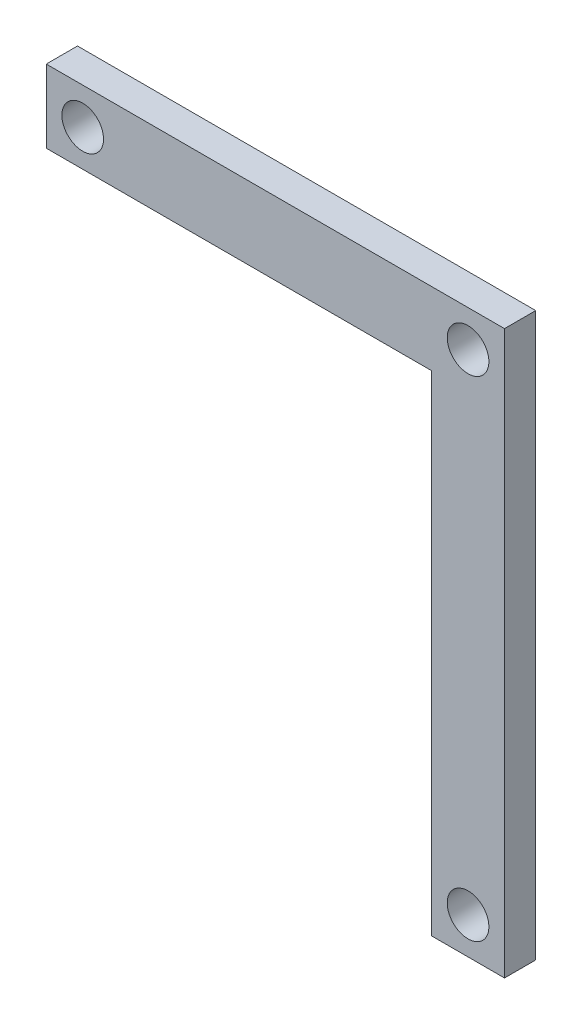
ISO-10303-21;
HEADER;
FILE_DESCRIPTION(('STEP AP214'),'2;1');
FILE_NAME('part.step','',(''),(''),'','','');
FILE_SCHEMA(('AUTOMOTIVE_DESIGN { 1 0 10303 214 1 1 1 1 }'));
ENDSEC;
DATA;
#1=APPLICATION_CONTEXT('core data for automotive mechanical design processes');
#2=APPLICATION_PROTOCOL_DEFINITION('international standard','automotive_design',2000,#1);
#3=PRODUCT_CONTEXT('',#1,'mechanical');
#4=PRODUCT('Part','Part','',(#3));
#5=PRODUCT_RELATED_PRODUCT_CATEGORY('part','',(#4));
#6=PRODUCT_DEFINITION_FORMATION('','',#4);
#7=PRODUCT_DEFINITION_CONTEXT('part definition',#1,'design');
#8=PRODUCT_DEFINITION('design','',#6,#7);
#9=PRODUCT_DEFINITION_SHAPE('','',#8);
#10=(LENGTH_UNIT() NAMED_UNIT(*) SI_UNIT(.MILLI.,.METRE.));
#11=(NAMED_UNIT(*) PLANE_ANGLE_UNIT() SI_UNIT($,.RADIAN.));
#12=(NAMED_UNIT(*) SI_UNIT($,.STERADIAN.) SOLID_ANGLE_UNIT());
#13=UNCERTAINTY_MEASURE_WITH_UNIT(LENGTH_MEASURE(1.E-05),#10,'distance_accuracy_value','');
#14=(GEOMETRIC_REPRESENTATION_CONTEXT(3) GLOBAL_UNCERTAINTY_ASSIGNED_CONTEXT((#13)) GLOBAL_UNIT_ASSIGNED_CONTEXT((#10,
#11,#12)) REPRESENTATION_CONTEXT('',''));
#15=CARTESIAN_POINT('',(0.,0.,0.));
#16=DIRECTION('',(0.,0.,1.));
#17=DIRECTION('',(1.,0.,0.));
#18=AXIS2_PLACEMENT_3D('',#15,#16,#17);
#19=CARTESIAN_POINT('',(0.,-270.,15.));
#20=DIRECTION('',(-1.,0.,0.));
#21=DIRECTION('',(0.,0.,1.));
#22=AXIS2_PLACEMENT_3D('',#19,#20,#21);
#23=PLANE('',#22);
#24=DIRECTION('',(0.,1.,0.));
#25=VECTOR('',#24,1.);
#26=CARTESIAN_POINT('',(0.,-270.,0.));
#27=LINE('',#26,#25);
#28=CARTESIAN_POINT('',(0.,-270.,0.));
#29=VERTEX_POINT('',#28);
#30=CARTESIAN_POINT('',(0.,0.,0.));
#31=VERTEX_POINT('',#30);
#32=EDGE_CURVE('E117',#29,#31,#27,.T.);
#33=ORIENTED_EDGE('',*,*,#32,.T.);
#34=DIRECTION('',(0.,0.,-1.));
#35=VECTOR('',#34,1.);
#36=CARTESIAN_POINT('',(0.,0.,15.));
#37=LINE('',#36,#35);
#38=CARTESIAN_POINT('',(0.,0.,15.));
#39=VERTEX_POINT('',#38);
#40=EDGE_CURVE('E11',#39,#31,#37,.T.);
#41=ORIENTED_EDGE('',*,*,#40,.F.);
#42=DIRECTION('',(0.,1.,0.));
#43=VECTOR('',#42,1.);
#44=CARTESIAN_POINT('',(0.,-270.,15.));
#45=LINE('',#44,#43);
#46=CARTESIAN_POINT('',(0.,-270.,15.));
#47=VERTEX_POINT('',#46);
#48=EDGE_CURVE('E128',#47,#39,#45,.T.);
#49=ORIENTED_EDGE('',*,*,#48,.F.);
#50=DIRECTION('',(0.,0.,-1.));
#51=VECTOR('',#50,1.);
#52=CARTESIAN_POINT('',(0.,-270.,15.));
#53=LINE('',#52,#51);
#54=EDGE_CURVE('E113',#47,#29,#53,.T.);
#55=ORIENTED_EDGE('',*,*,#54,.T.);
#56=EDGE_LOOP('',(#33,#41,#49,#55));
#57=FACE_BOUND('',#56,.T.);
#58=ADVANCED_FACE('F32',(#57),#23,.F.);
#59=CARTESIAN_POINT('',(0.,0.,15.));
#60=DIRECTION('',(0.,-1.,0.));
#61=DIRECTION('',(1.,0.,0.));
#62=AXIS2_PLACEMENT_3D('',#59,#60,#61);
#63=PLANE('',#62);
#64=DIRECTION('',(-1.,0.,0.));
#65=VECTOR('',#64,1.);
#66=CARTESIAN_POINT('',(0.,0.,0.));
#67=LINE('',#66,#65);
#68=CARTESIAN_POINT('',(-220.,0.,0.));
#69=VERTEX_POINT('',#68);
#70=EDGE_CURVE('E120',#31,#69,#67,.T.);
#71=ORIENTED_EDGE('',*,*,#70,.T.);
#72=DIRECTION('',(0.,0.,-1.));
#73=VECTOR('',#72,1.);
#74=CARTESIAN_POINT('',(-220.,0.,15.));
#75=LINE('',#74,#73);
#76=CARTESIAN_POINT('',(-220.,0.,15.));
#77=VERTEX_POINT('',#76);
#78=EDGE_CURVE('E41',#77,#69,#75,.T.);
#79=ORIENTED_EDGE('',*,*,#78,.F.);
#80=DIRECTION('',(-1.,0.,0.));
#81=VECTOR('',#80,1.);
#82=CARTESIAN_POINT('',(0.,0.,15.));
#83=LINE('',#82,#81);
#84=EDGE_CURVE('E86',#39,#77,#83,.T.);
#85=ORIENTED_EDGE('',*,*,#84,.F.);
#86=ORIENTED_EDGE('',*,*,#40,.T.);
#87=EDGE_LOOP('',(#71,#79,#85,#86));
#88=FACE_BOUND('',#87,.T.);
#89=ADVANCED_FACE('F154',(#88),#63,.F.);
#90=CARTESIAN_POINT('',(-220.,0.,15.));
#91=DIRECTION('',(1.,0.,0.));
#92=DIRECTION('',(0.,0.,-1.));
#93=AXIS2_PLACEMENT_3D('',#90,#91,#92);
#94=PLANE('',#93);
#95=DIRECTION('',(0.,-1.,0.));
#96=VECTOR('',#95,1.);
#97=CARTESIAN_POINT('',(-220.,0.,0.));
#98=LINE('',#97,#96);
#99=CARTESIAN_POINT('',(-220.,-35.,0.));
#100=VERTEX_POINT('',#99);
#101=EDGE_CURVE('E123',#69,#100,#98,.T.);
#102=ORIENTED_EDGE('',*,*,#101,.T.);
#103=DIRECTION('',(0.,0.,-1.));
#104=VECTOR('',#103,1.);
#105=CARTESIAN_POINT('',(-220.,-35.,15.));
#106=LINE('',#105,#104);
#107=CARTESIAN_POINT('',(-220.,-35.,15.));
#108=VERTEX_POINT('',#107);
#109=EDGE_CURVE('E108',#108,#100,#106,.T.);
#110=ORIENTED_EDGE('',*,*,#109,.F.);
#111=DIRECTION('',(0.,-1.,0.));
#112=VECTOR('',#111,1.);
#113=CARTESIAN_POINT('',(-220.,0.,15.));
#114=LINE('',#113,#112);
#115=EDGE_CURVE('E99',#77,#108,#114,.T.);
#116=ORIENTED_EDGE('',*,*,#115,.F.);
#117=ORIENTED_EDGE('',*,*,#78,.T.);
#118=EDGE_LOOP('',(#102,#110,#116,#117));
#119=FACE_BOUND('',#118,.T.);
#120=ADVANCED_FACE('F135',(#119),#94,.F.);
#121=CARTESIAN_POINT('',(-220.,-35.,15.));
#122=DIRECTION('',(0.,1.,0.));
#123=DIRECTION('',(-1.,0.,0.));
#124=AXIS2_PLACEMENT_3D('',#121,#122,#123);
#125=PLANE('',#124);
#126=DIRECTION('',(1.,0.,0.));
#127=VECTOR('',#126,1.);
#128=CARTESIAN_POINT('',(-220.,-35.,0.));
#129=LINE('',#128,#127);
#130=CARTESIAN_POINT('',(-35.,-35.,0.));
#131=VERTEX_POINT('',#130);
#132=EDGE_CURVE('E107',#100,#131,#129,.T.);
#133=ORIENTED_EDGE('',*,*,#132,.T.);
#134=DIRECTION('',(0.,0.,-1.));
#135=VECTOR('',#134,1.);
#136=CARTESIAN_POINT('',(-35.,-35.,15.));
#137=LINE('',#136,#135);
#138=CARTESIAN_POINT('',(-35.,-35.,15.));
#139=VERTEX_POINT('',#138);
#140=EDGE_CURVE('E104',#139,#131,#137,.T.);
#141=ORIENTED_EDGE('',*,*,#140,.F.);
#142=DIRECTION('',(1.,0.,0.));
#143=VECTOR('',#142,1.);
#144=CARTESIAN_POINT('',(-220.,-35.,15.));
#145=LINE('',#144,#143);
#146=EDGE_CURVE('E93',#108,#139,#145,.T.);
#147=ORIENTED_EDGE('',*,*,#146,.F.);
#148=ORIENTED_EDGE('',*,*,#109,.T.);
#149=EDGE_LOOP('',(#133,#141,#147,#148));
#150=FACE_BOUND('',#149,.T.);
#151=ADVANCED_FACE('F105',(#150),#125,.F.);
#152=CARTESIAN_POINT('',(-35.,-35.,15.));
#153=DIRECTION('',(1.,0.,0.));
#154=DIRECTION('',(0.,1.,0.));
#155=AXIS2_PLACEMENT_3D('',#152,#153,#154);
#156=PLANE('',#155);
#157=DIRECTION('',(0.,-1.,0.));
#158=VECTOR('',#157,1.);
#159=CARTESIAN_POINT('',(-35.,-35.,0.));
#160=LINE('',#159,#158);
#161=CARTESIAN_POINT('',(-35.,-270.,0.));
#162=VERTEX_POINT('',#161);
#163=EDGE_CURVE('E72',#131,#162,#160,.T.);
#164=ORIENTED_EDGE('',*,*,#163,.T.);
#165=DIRECTION('',(0.,0.,-1.));
#166=VECTOR('',#165,1.);
#167=CARTESIAN_POINT('',(-35.,-270.,15.));
#168=LINE('',#167,#166);
#169=CARTESIAN_POINT('',(-35.,-270.,15.));
#170=VERTEX_POINT('',#169);
#171=EDGE_CURVE('E109',#170,#162,#168,.T.);
#172=ORIENTED_EDGE('',*,*,#171,.F.);
#173=DIRECTION('',(0.,-1.,0.));
#174=VECTOR('',#173,1.);
#175=CARTESIAN_POINT('',(-35.,-35.,15.));
#176=LINE('',#175,#174);
#177=EDGE_CURVE('E97',#139,#170,#176,.T.);
#178=ORIENTED_EDGE('',*,*,#177,.F.);
#179=ORIENTED_EDGE('',*,*,#140,.T.);
#180=EDGE_LOOP('',(#164,#172,#178,#179));
#181=FACE_BOUND('',#180,.T.);
#182=ADVANCED_FACE('F111',(#181),#156,.F.);
#183=CARTESIAN_POINT('',(-35.,-270.,15.));
#184=DIRECTION('',(0.,1.,0.));
#185=DIRECTION('',(0.,0.,1.));
#186=AXIS2_PLACEMENT_3D('',#183,#184,#185);
#187=PLANE('',#186);
#188=DIRECTION('',(1.,0.,0.));
#189=VECTOR('',#188,1.);
#190=CARTESIAN_POINT('',(-35.,-270.,0.));
#191=LINE('',#190,#189);
#192=EDGE_CURVE('E78',#162,#29,#191,.T.);
#193=ORIENTED_EDGE('',*,*,#192,.T.);
#194=ORIENTED_EDGE('',*,*,#54,.F.);
#195=DIRECTION('',(1.,0.,0.));
#196=VECTOR('',#195,1.);
#197=CARTESIAN_POINT('',(-35.,-270.,15.));
#198=LINE('',#197,#196);
#199=EDGE_CURVE('E49',#170,#47,#198,.T.);
#200=ORIENTED_EDGE('',*,*,#199,.F.);
#201=ORIENTED_EDGE('',*,*,#171,.T.);
#202=EDGE_LOOP('',(#193,#194,#200,#201));
#203=FACE_BOUND('',#202,.T.);
#204=ADVANCED_FACE('F142',(#203),#187,.F.);
#205=CARTESIAN_POINT('',(0.,0.,15.));
#206=DIRECTION('',(0.,0.,1.));
#207=DIRECTION('',(1.,0.,0.));
#208=AXIS2_PLACEMENT_3D('',#205,#206,#207);
#209=PLANE('',#208);
#210=CARTESIAN_POINT('',(-17.5,-17.5,15.));
#211=DIRECTION('',(0.,0.,1.));
#212=DIRECTION('',(1.,0.,0.));
#213=AXIS2_PLACEMENT_3D('',#210,#211,#212);
#214=CIRCLE('',#213,9.99999999999999);
#215=CARTESIAN_POINT('',(-7.50000000000002,-17.5,15.));
#216=VERTEX_POINT('',#215);
#217=EDGE_CURVE('E227',#216,#216,#214,.T.);
#218=ORIENTED_EDGE('',*,*,#217,.F.);
#219=EDGE_LOOP('',(#218));
#220=FACE_BOUND('',#219,.T.);
#221=CARTESIAN_POINT('',(-202.5,-17.5,15.));
#222=DIRECTION('',(0.,0.,1.));
#223=DIRECTION('',(1.,0.,0.));
#224=AXIS2_PLACEMENT_3D('',#221,#222,#223);
#225=CIRCLE('',#224,9.99999999999998);
#226=CARTESIAN_POINT('',(-192.5,-17.5,15.));
#227=VERTEX_POINT('',#226);
#228=EDGE_CURVE('E230',#227,#227,#225,.T.);
#229=ORIENTED_EDGE('',*,*,#228,.F.);
#230=EDGE_LOOP('',(#229));
#231=FACE_BOUND('',#230,.T.);
#232=CARTESIAN_POINT('',(-17.5,-252.5,15.));
#233=DIRECTION('',(0.,0.,1.));
#234=DIRECTION('',(1.,0.,0.));
#235=AXIS2_PLACEMENT_3D('',#232,#233,#234);
#236=CIRCLE('',#235,9.99999999999999);
#237=CARTESIAN_POINT('',(-7.50000000000002,-252.5,15.));
#238=VERTEX_POINT('',#237);
#239=EDGE_CURVE('E238',#238,#238,#236,.T.);
#240=ORIENTED_EDGE('',*,*,#239,.F.);
#241=EDGE_LOOP('',(#240));
#242=FACE_BOUND('',#241,.T.);
#243=ORIENTED_EDGE('',*,*,#48,.T.);
#244=ORIENTED_EDGE('',*,*,#84,.T.);
#245=ORIENTED_EDGE('',*,*,#115,.T.);
#246=ORIENTED_EDGE('',*,*,#146,.T.);
#247=ORIENTED_EDGE('',*,*,#177,.T.);
#248=ORIENTED_EDGE('',*,*,#199,.T.);
#249=EDGE_LOOP('',(#243,#244,#245,#246,#247,#248));
#250=FACE_BOUND('',#249,.T.);
#251=ADVANCED_FACE('F95',(#220,#231,#242,#250),#209,.T.);
#252=CARTESIAN_POINT('',(0.,0.,0.));
#253=DIRECTION('',(0.,0.,1.));
#254=DIRECTION('',(1.,0.,0.));
#255=AXIS2_PLACEMENT_3D('',#252,#253,#254);
#256=PLANE('',#255);
#257=CARTESIAN_POINT('',(-17.5,-17.5,0.));
#258=DIRECTION('',(0.,0.,1.));
#259=DIRECTION('',(1.,0.,0.));
#260=AXIS2_PLACEMENT_3D('',#257,#258,#259);
#261=CIRCLE('',#260,9.99999999999999);
#262=CARTESIAN_POINT('',(-7.50000000000002,-17.5,0.));
#263=VERTEX_POINT('',#262);
#264=EDGE_CURVE('E35',#263,#263,#261,.T.);
#265=ORIENTED_EDGE('',*,*,#264,.T.);
#266=EDGE_LOOP('',(#265));
#267=FACE_BOUND('',#266,.T.);
#268=CARTESIAN_POINT('',(-202.5,-17.5,0.));
#269=DIRECTION('',(0.,0.,1.));
#270=DIRECTION('',(1.,0.,0.));
#271=AXIS2_PLACEMENT_3D('',#268,#269,#270);
#272=CIRCLE('',#271,9.99999999999998);
#273=CARTESIAN_POINT('',(-192.5,-17.5,0.));
#274=VERTEX_POINT('',#273);
#275=EDGE_CURVE('E232',#274,#274,#272,.T.);
#276=ORIENTED_EDGE('',*,*,#275,.T.);
#277=EDGE_LOOP('',(#276));
#278=FACE_BOUND('',#277,.T.);
#279=CARTESIAN_POINT('',(-17.5,-252.5,0.));
#280=DIRECTION('',(0.,0.,1.));
#281=DIRECTION('',(1.,0.,0.));
#282=AXIS2_PLACEMENT_3D('',#279,#280,#281);
#283=CIRCLE('',#282,9.99999999999999);
#284=CARTESIAN_POINT('',(-7.50000000000002,-252.5,0.));
#285=VERTEX_POINT('',#284);
#286=EDGE_CURVE('E121',#285,#285,#283,.T.);
#287=ORIENTED_EDGE('',*,*,#286,.T.);
#288=EDGE_LOOP('',(#287));
#289=FACE_BOUND('',#288,.T.);
#290=ORIENTED_EDGE('',*,*,#32,.F.);
#291=ORIENTED_EDGE('',*,*,#192,.F.);
#292=ORIENTED_EDGE('',*,*,#163,.F.);
#293=ORIENTED_EDGE('',*,*,#132,.F.);
#294=ORIENTED_EDGE('',*,*,#101,.F.);
#295=ORIENTED_EDGE('',*,*,#70,.F.);
#296=EDGE_LOOP('',(#290,#291,#292,#293,#294,#295));
#297=FACE_BOUND('',#296,.T.);
#298=ADVANCED_FACE('F138',(#267,#278,#289,#297),#256,.F.);
#299=CARTESIAN_POINT('',(-17.5,-252.5,15.));
#300=DIRECTION('',(0.,0.,1.));
#301=DIRECTION('',(1.,0.,0.));
#302=AXIS2_PLACEMENT_3D('',#299,#300,#301);
#303=CYLINDRICAL_SURFACE('',#302,9.99999999999999);
#304=ORIENTED_EDGE('',*,*,#239,.T.);
#305=EDGE_LOOP('',(#304));
#306=FACE_BOUND('',#305,.T.);
#307=ORIENTED_EDGE('',*,*,#286,.F.);
#308=EDGE_LOOP('',(#307));
#309=FACE_BOUND('',#308,.T.);
#310=ADVANCED_FACE('F191',(#306,#309),#303,.F.);
#311=CARTESIAN_POINT('',(-202.5,-17.5,15.));
#312=DIRECTION('',(0.,0.,1.));
#313=DIRECTION('',(1.,0.,0.));
#314=AXIS2_PLACEMENT_3D('',#311,#312,#313);
#315=CYLINDRICAL_SURFACE('',#314,9.99999999999998);
#316=ORIENTED_EDGE('',*,*,#228,.T.);
#317=EDGE_LOOP('',(#316));
#318=FACE_BOUND('',#317,.T.);
#319=ORIENTED_EDGE('',*,*,#275,.F.);
#320=EDGE_LOOP('',(#319));
#321=FACE_BOUND('',#320,.T.);
#322=ADVANCED_FACE('F200',(#318,#321),#315,.F.);
#323=CARTESIAN_POINT('',(-17.5,-17.5,15.));
#324=DIRECTION('',(0.,0.,1.));
#325=DIRECTION('',(1.,0.,0.));
#326=AXIS2_PLACEMENT_3D('',#323,#324,#325);
#327=CYLINDRICAL_SURFACE('',#326,9.99999999999999);
#328=ORIENTED_EDGE('',*,*,#217,.T.);
#329=EDGE_LOOP('',(#328));
#330=FACE_BOUND('',#329,.T.);
#331=ORIENTED_EDGE('',*,*,#264,.F.);
#332=EDGE_LOOP('',(#331));
#333=FACE_BOUND('',#332,.T.);
#334=ADVANCED_FACE('F210',(#330,#333),#327,.F.);
#335=CLOSED_SHELL('',(#58,#89,#120,#151,#182,#204,#251,#298,#310,#322,#334));
#336=MANIFOLD_SOLID_BREP('B2',#335);
#337=ADVANCED_BREP_SHAPE_REPRESENTATION('',(#18,#336),#14);
#338=SHAPE_DEFINITION_REPRESENTATION(#9,#337);
ENDSEC;
END-ISO-10303-21;
